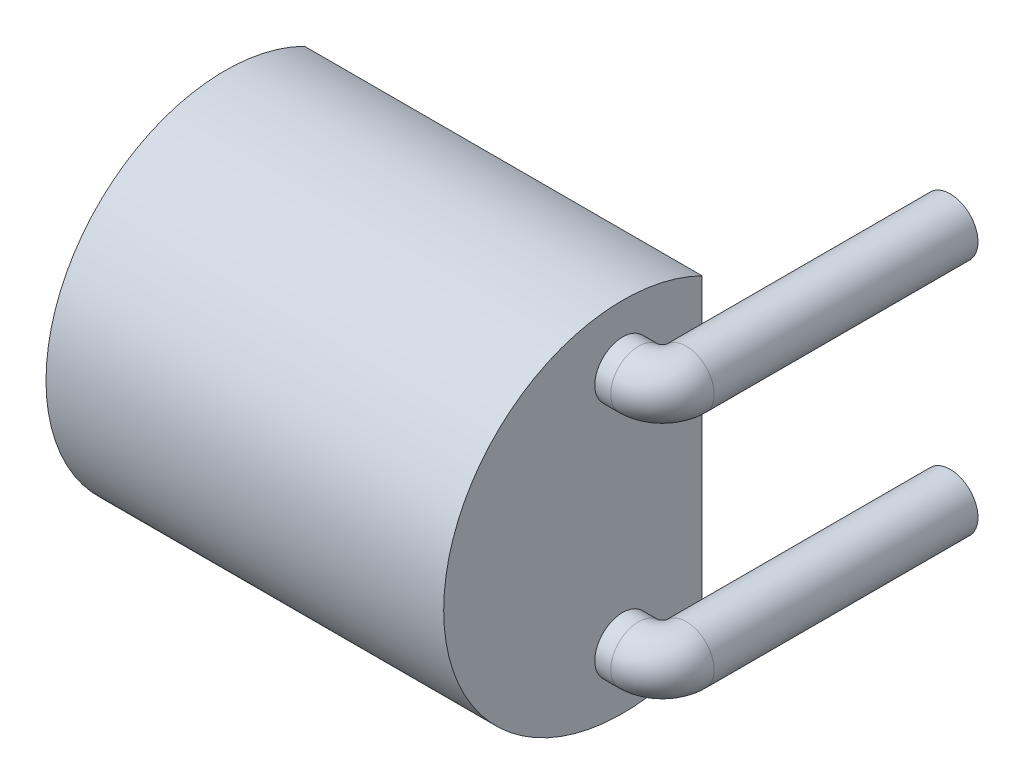
ISO-10303-21;
HEADER;
FILE_DESCRIPTION(('STEP AP214'),'2;1');
FILE_NAME('part.step','',(''),(''),'','','');
FILE_SCHEMA(('AUTOMOTIVE_DESIGN { 1 0 10303 214 1 1 1 1 }'));
ENDSEC;
DATA;
#1=APPLICATION_CONTEXT('core data for automotive mechanical design processes');
#2=APPLICATION_PROTOCOL_DEFINITION('international standard','automotive_design',2000,#1);
#3=PRODUCT_CONTEXT('',#1,'mechanical');
#4=PRODUCT('Part','Part','',(#3));
#5=PRODUCT_RELATED_PRODUCT_CATEGORY('part','',(#4));
#6=PRODUCT_DEFINITION_FORMATION('','',#4);
#7=PRODUCT_DEFINITION_CONTEXT('part definition',#1,'design');
#8=PRODUCT_DEFINITION('design','',#6,#7);
#9=PRODUCT_DEFINITION_SHAPE('','',#8);
#10=(LENGTH_UNIT() NAMED_UNIT(*) SI_UNIT(.MILLI.,.METRE.));
#11=(NAMED_UNIT(*) PLANE_ANGLE_UNIT() SI_UNIT($,.RADIAN.));
#12=(NAMED_UNIT(*) SI_UNIT($,.STERADIAN.) SOLID_ANGLE_UNIT());
#13=UNCERTAINTY_MEASURE_WITH_UNIT(LENGTH_MEASURE(1.E-05),#10,'distance_accuracy_value','');
#14=(GEOMETRIC_REPRESENTATION_CONTEXT(3) GLOBAL_UNCERTAINTY_ASSIGNED_CONTEXT((#13)) GLOBAL_UNIT_ASSIGNED_CONTEXT((#10,
#11,#12)) REPRESENTATION_CONTEXT('',''));
#15=CARTESIAN_POINT('',(0.,0.,0.));
#16=DIRECTION('',(0.,0.,1.));
#17=DIRECTION('',(1.,0.,0.));
#18=AXIS2_PLACEMENT_3D('',#15,#16,#17);
#19=CARTESIAN_POINT('',(5.,1.50000000000005,8.99999999999996));
#20=DIRECTION('',(1.,0.,0.));
#21=DIRECTION('',(0.,1.,0.));
#22=AXIS2_PLACEMENT_3D('',#19,#20,#21);
#23=CYLINDRICAL_SURFACE('',#22,0.35);
#24=CARTESIAN_POINT('',(5.5,1.50000000000005,8.99999999999996));
#25=DIRECTION('',(0.707106781186548,0.,-0.707106781186547));
#26=DIRECTION('',(0.707106781186547,0.,0.707106781186548));
#27=AXIS2_PLACEMENT_3D('',#24,#25,#26);
#28=ELLIPSE('',#27,0.494974746830584,0.35);
#29=CARTESIAN_POINT('',(5.2,1.31972243622685,8.69999999999997));
#30=VERTEX_POINT('',#29);
#31=CARTESIAN_POINT('',(5.2,1.68027756377325,8.69999999999996));
#32=VERTEX_POINT('',#31);
#33=EDGE_CURVE('E76',#30,#32,#28,.T.);
#34=ORIENTED_EDGE('',*,*,#33,.F.);
#35=CARTESIAN_POINT('',(5.2,1.50000000000005,8.99999999999996));
#36=DIRECTION('',(1.,0.,0.));
#37=DIRECTION('',(0.,1.,0.));
#38=AXIS2_PLACEMENT_3D('',#35,#36,#37);
#39=CIRCLE('',#38,0.35);
#40=EDGE_CURVE('E53',#30,#32,#39,.F.);
#41=ORIENTED_EDGE('',*,*,#40,.T.);
#42=EDGE_LOOP('',(#34,#41));
#43=FACE_BOUND('',#42,.T.);
#44=CARTESIAN_POINT('',(5.,1.50000000000005,8.99999999999996));
#45=DIRECTION('',(1.,0.,0.));
#46=DIRECTION('',(0.,1.,0.));
#47=AXIS2_PLACEMENT_3D('',#44,#45,#46);
#48=CIRCLE('',#47,0.35);
#49=CARTESIAN_POINT('',(5.,1.85000000000005,8.99999999999996));
#50=VERTEX_POINT('',#49);
#51=EDGE_CURVE('E113',#50,#50,#48,.T.);
#52=ORIENTED_EDGE('',*,*,#51,.T.);
#53=EDGE_LOOP('',(#52));
#54=FACE_BOUND('',#53,.T.);
#55=ADVANCED_FACE('F31',(#43,#54),#23,.T.);
#56=CARTESIAN_POINT('',(5.,-1.49999999999995,8.99999999999996));
#57=DIRECTION('',(1.,0.,0.));
#58=DIRECTION('',(0.,1.,0.));
#59=AXIS2_PLACEMENT_3D('',#56,#57,#58);
#60=CYLINDRICAL_SURFACE('',#59,0.35);
#61=CARTESIAN_POINT('',(5.49999999999999,-1.49999999999995,8.99999999999996));
#62=DIRECTION('',(0.707106781186548,0.,-0.707106781186547));
#63=DIRECTION('',(0.707106781186547,0.,0.707106781186548));
#64=AXIS2_PLACEMENT_3D('',#61,#62,#63);
#65=ELLIPSE('',#64,0.494974746830584,0.35);
#66=CARTESIAN_POINT('',(5.2,-1.68027756377316,8.69999999999997));
#67=VERTEX_POINT('',#66);
#68=CARTESIAN_POINT('',(5.2,-1.31972243622674,8.69999999999996));
#69=VERTEX_POINT('',#68);
#70=EDGE_CURVE('E74',#67,#69,#65,.T.);
#71=ORIENTED_EDGE('',*,*,#70,.F.);
#72=CARTESIAN_POINT('',(5.2,-1.49999999999995,8.99999999999996));
#73=DIRECTION('',(1.,0.,0.));
#74=DIRECTION('',(0.,1.,0.));
#75=AXIS2_PLACEMENT_3D('',#72,#73,#74);
#76=CIRCLE('',#75,0.35);
#77=EDGE_CURVE('E46',#67,#69,#76,.F.);
#78=ORIENTED_EDGE('',*,*,#77,.T.);
#79=EDGE_LOOP('',(#71,#78));
#80=FACE_BOUND('',#79,.T.);
#81=CARTESIAN_POINT('',(5.,-1.49999999999995,8.99999999999996));
#82=DIRECTION('',(1.,0.,0.));
#83=DIRECTION('',(0.,1.,0.));
#84=AXIS2_PLACEMENT_3D('',#81,#82,#83);
#85=CIRCLE('',#84,0.35);
#86=CARTESIAN_POINT('',(5.,-1.14999999999995,8.99999999999996));
#87=VERTEX_POINT('',#86);
#88=EDGE_CURVE('E117',#87,#87,#85,.T.);
#89=ORIENTED_EDGE('',*,*,#88,.T.);
#90=EDGE_LOOP('',(#89));
#91=FACE_BOUND('',#90,.T.);
#92=ADVANCED_FACE('F72',(#80,#91),#60,.T.);
#93=CARTESIAN_POINT('',(0.,0.,8.99999999999996));
#94=DIRECTION('',(-1.,0.,0.));
#95=DIRECTION('',(0.,-1.,0.));
#96=AXIS2_PLACEMENT_3D('',#93,#94,#95);
#97=PLANE('',#96);
#98=CARTESIAN_POINT('',(0.,0.,8.99999999999996));
#99=DIRECTION('',(1.,0.,0.));
#100=DIRECTION('',(0.,1.,0.));
#101=AXIS2_PLACEMENT_3D('',#98,#99,#100);
#102=CIRCLE('',#101,2.25);
#103=CARTESIAN_POINT('',(0.,2.01556443707459,7.99999999999996));
#104=VERTEX_POINT('',#103);
#105=CARTESIAN_POINT('',(0.,-2.01556443707459,7.99999999999996));
#106=VERTEX_POINT('',#105);
#107=EDGE_CURVE('E39',#104,#106,#102,.T.);
#108=ORIENTED_EDGE('',*,*,#107,.F.);
#109=DIRECTION('',(0.,-1.,0.));
#110=VECTOR('',#109,1.);
#111=CARTESIAN_POINT('',(0.,0.,7.99999999999996));
#112=LINE('',#111,#110);
#113=EDGE_CURVE('E109',#104,#106,#112,.T.);
#114=ORIENTED_EDGE('',*,*,#113,.T.);
#115=EDGE_LOOP('',(#108,#114));
#116=FACE_BOUND('',#115,.T.);
#117=ADVANCED_FACE('F149',(#116),#97,.T.);
#118=CARTESIAN_POINT('',(5.,0.,8.99999999999996));
#119=DIRECTION('',(-1.,0.,0.));
#120=DIRECTION('',(0.,-1.,0.));
#121=AXIS2_PLACEMENT_3D('',#118,#119,#120);
#122=PLANE('',#121);
#123=ORIENTED_EDGE('',*,*,#51,.F.);
#124=EDGE_LOOP('',(#123));
#125=FACE_BOUND('',#124,.T.);
#126=ORIENTED_EDGE('',*,*,#88,.F.);
#127=EDGE_LOOP('',(#126));
#128=FACE_BOUND('',#127,.T.);
#129=DIRECTION('',(0.,-1.,0.));
#130=VECTOR('',#129,1.);
#131=CARTESIAN_POINT('',(5.,2.01556443707459,7.99999999999996));
#132=LINE('',#131,#130);
#133=CARTESIAN_POINT('',(5.,2.01556443707459,7.99999999999996));
#134=VERTEX_POINT('',#133);
#135=CARTESIAN_POINT('',(5.,-2.01556443707459,7.99999999999996));
#136=VERTEX_POINT('',#135);
#137=EDGE_CURVE('E104',#134,#136,#132,.T.);
#138=ORIENTED_EDGE('',*,*,#137,.F.);
#139=CARTESIAN_POINT('',(5.,0.,8.99999999999996));
#140=DIRECTION('',(1.,0.,0.));
#141=DIRECTION('',(0.,1.,0.));
#142=AXIS2_PLACEMENT_3D('',#139,#140,#141);
#143=CIRCLE('',#142,2.25);
#144=EDGE_CURVE('E11',#136,#134,#143,.F.);
#145=ORIENTED_EDGE('',*,*,#144,.F.);
#146=EDGE_LOOP('',(#138,#145));
#147=FACE_BOUND('',#146,.T.);
#148=ADVANCED_FACE('F154',(#125,#128,#147),#122,.F.);
#149=CARTESIAN_POINT('',(0.,0.,8.99999999999996));
#150=DIRECTION('',(1.,0.,0.));
#151=DIRECTION('',(0.,1.,0.));
#152=AXIS2_PLACEMENT_3D('',#149,#150,#151);
#153=CYLINDRICAL_SURFACE('',#152,2.25);
#154=ORIENTED_EDGE('',*,*,#144,.T.);
#155=DIRECTION('',(-1.,0.,0.));
#156=VECTOR('',#155,1.);
#157=CARTESIAN_POINT('',(5.,2.01556443707459,7.99999999999996));
#158=LINE('',#157,#156);
#159=EDGE_CURVE('E107',#134,#104,#158,.T.);
#160=ORIENTED_EDGE('',*,*,#159,.T.);
#161=ORIENTED_EDGE('',*,*,#107,.T.);
#162=DIRECTION('',(-1.,0.,0.));
#163=VECTOR('',#162,1.);
#164=CARTESIAN_POINT('',(5.,-2.01556443707458,7.99999999999996));
#165=LINE('',#164,#163);
#166=EDGE_CURVE('E106',#136,#106,#165,.T.);
#167=ORIENTED_EDGE('',*,*,#166,.F.);
#168=EDGE_LOOP('',(#154,#160,#161,#167));
#169=FACE_BOUND('',#168,.T.);
#170=ADVANCED_FACE('F160',(#169),#153,.T.);
#171=CARTESIAN_POINT('',(5.,2.01556443707459,7.99999999999996));
#172=DIRECTION('',(0.,0.,-1.));
#173=DIRECTION('',(-1.,0.,0.));
#174=AXIS2_PLACEMENT_3D('',#171,#172,#173);
#175=PLANE('',#174);
#176=ORIENTED_EDGE('',*,*,#113,.F.);
#177=ORIENTED_EDGE('',*,*,#159,.F.);
#178=ORIENTED_EDGE('',*,*,#137,.T.);
#179=ORIENTED_EDGE('',*,*,#166,.T.);
#180=EDGE_LOOP('',(#176,#177,#178,#179));
#181=FACE_BOUND('',#180,.T.);
#182=ADVANCED_FACE('F139',(#181),#175,.T.);
#183=CARTESIAN_POINT('',(5.5,1.50000000000005,8.69999999999996));
#184=DIRECTION('',(0.,0.,-1.));
#185=DIRECTION('',(-1.,0.,0.));
#186=AXIS2_PLACEMENT_3D('',#183,#184,#185);
#187=CYLINDRICAL_SURFACE('',#186,0.350000000000001);
#188=CARTESIAN_POINT('',(5.5,1.50000000000005,8.69999999999996));
#189=DIRECTION('',(0.,0.,-1.));
#190=DIRECTION('',(0.,1.,0.));
#191=AXIS2_PLACEMENT_3D('',#188,#189,#190);
#192=CIRCLE('',#191,0.350000000000001);
#193=EDGE_CURVE('E81',#32,#30,#192,.T.);
#194=ORIENTED_EDGE('',*,*,#193,.T.);
#195=ORIENTED_EDGE('',*,*,#33,.T.);
#196=EDGE_LOOP('',(#194,#195));
#197=FACE_BOUND('',#196,.T.);
#198=CARTESIAN_POINT('',(5.5,1.50000000000005,5.3821704001239));
#199=DIRECTION('',(0.,0.,-1.));
#200=DIRECTION('',(0.,1.,0.));
#201=AXIS2_PLACEMENT_3D('',#198,#199,#200);
#202=CIRCLE('',#201,0.350000000000001);
#203=CARTESIAN_POINT('',(5.5,1.85000000000005,5.3821704001239));
#204=VERTEX_POINT('',#203);
#205=EDGE_CURVE('E93',#204,#204,#202,.T.);
#206=ORIENTED_EDGE('',*,*,#205,.F.);
#207=EDGE_LOOP('',(#206));
#208=FACE_BOUND('',#207,.T.);
#209=ADVANCED_FACE('F127',(#197,#208),#187,.T.);
#210=CARTESIAN_POINT('',(5.2,1.50000000000005,8.39999999999996));
#211=DIRECTION('',(-1.,0.,0.));
#212=DIRECTION('',(0.,0.,-1.));
#213=AXIS2_PLACEMENT_3D('',#210,#211,#212);
#214=CIRCLE('',#213,0.350000000000001);
#215=TRIMMED_CURVE('',#214,(PARAMETER_VALUE(-2.60049312763264)),
(PARAMETER_VALUE(2.60049312763264)),.T.,.PARAMETER.);
#216=CARTESIAN_POINT('',(5.2,1.50000000000005,8.69999999999996));
#217=DIRECTION('',(0.,-1.,0.));
#218=AXIS1_PLACEMENT('',#216,#217);
#219=SURFACE_OF_REVOLUTION('',#215,#218);
#220=ORIENTED_EDGE('',*,*,#193,.F.);
#221=ORIENTED_EDGE('',*,*,#40,.F.);
#222=EDGE_LOOP('',(#220,#221));
#223=FACE_BOUND('',#222,.T.);
#224=ADVANCED_FACE('F129',(#223),#219,.T.);
#225=CARTESIAN_POINT('',(5.5,1.50000000000005,5.3821704001239));
#226=DIRECTION('',(0.,0.,-1.));
#227=DIRECTION('',(0.,1.,0.));
#228=AXIS2_PLACEMENT_3D('',#225,#226,#227);
#229=PLANE('',#228);
#230=ORIENTED_EDGE('',*,*,#205,.T.);
#231=EDGE_LOOP('',(#230));
#232=FACE_BOUND('',#231,.T.);
#233=ADVANCED_FACE('F131',(#232),#229,.T.);
#234=CARTESIAN_POINT('',(5.49999999999999,-1.49999999999995,8.69999999999996));
#235=DIRECTION('',(0.,0.,-1.));
#236=DIRECTION('',(-1.,0.,0.));
#237=AXIS2_PLACEMENT_3D('',#234,#235,#236);
#238=CYLINDRICAL_SURFACE('',#237,0.350000000000001);
#239=CARTESIAN_POINT('',(5.49999999999999,-1.49999999999995,8.69999999999996));
#240=DIRECTION('',(0.,0.,-1.));
#241=DIRECTION('',(0.,1.,0.));
#242=AXIS2_PLACEMENT_3D('',#239,#240,#241);
#243=CIRCLE('',#242,0.350000000000001);
#244=EDGE_CURVE('E80',#69,#67,#243,.T.);
#245=ORIENTED_EDGE('',*,*,#244,.T.);
#246=ORIENTED_EDGE('',*,*,#70,.T.);
#247=EDGE_LOOP('',(#245,#246));
#248=FACE_BOUND('',#247,.T.);
#249=CARTESIAN_POINT('',(5.5,-1.49999999999995,5.38217040012389));
#250=DIRECTION('',(0.,0.,-1.));
#251=DIRECTION('',(0.,1.,0.));
#252=AXIS2_PLACEMENT_3D('',#249,#250,#251);
#253=CIRCLE('',#252,0.350000000000001);
#254=CARTESIAN_POINT('',(5.5,-1.14999999999995,5.38217040012389));
#255=VERTEX_POINT('',#254);
#256=EDGE_CURVE('E82',#255,#255,#253,.T.);
#257=ORIENTED_EDGE('',*,*,#256,.F.);
#258=EDGE_LOOP('',(#257));
#259=FACE_BOUND('',#258,.T.);
#260=ADVANCED_FACE('F78',(#248,#259),#238,.T.);
#261=CARTESIAN_POINT('',(5.2,-1.49999999999995,8.39999999999997));
#262=DIRECTION('',(-1.,0.,0.));
#263=DIRECTION('',(0.,0.,-1.));
#264=AXIS2_PLACEMENT_3D('',#261,#262,#263);
#265=CIRCLE('',#264,0.350000000000001);
#266=TRIMMED_CURVE('',#265,(PARAMETER_VALUE(-2.60049312763263)),
(PARAMETER_VALUE(2.60049312763263)),.T.,.PARAMETER.);
#267=CARTESIAN_POINT('',(5.2,-1.49999999999995,8.69999999999996));
#268=DIRECTION('',(0.,-1.,0.));
#269=AXIS1_PLACEMENT('',#267,#268);
#270=SURFACE_OF_REVOLUTION('',#266,#269);
#271=ORIENTED_EDGE('',*,*,#244,.F.);
#272=ORIENTED_EDGE('',*,*,#77,.F.);
#273=EDGE_LOOP('',(#271,#272));
#274=FACE_BOUND('',#273,.T.);
#275=ADVANCED_FACE('F84',(#274),#270,.T.);
#276=CARTESIAN_POINT('',(5.5,-1.49999999999995,5.38217040012389));
#277=DIRECTION('',(0.,0.,-1.));
#278=DIRECTION('',(0.,1.,0.));
#279=AXIS2_PLACEMENT_3D('',#276,#277,#278);
#280=PLANE('',#279);
#281=ORIENTED_EDGE('',*,*,#256,.T.);
#282=EDGE_LOOP('',(#281));
#283=FACE_BOUND('',#282,.T.);
#284=ADVANCED_FACE('F143',(#283),#280,.T.);
#285=CLOSED_SHELL('',(#55,#92,#117,#148,#170,#182,#209,#224,#233,#260,#275,#284));
#286=MANIFOLD_SOLID_BREP('B2',#285);
#287=ADVANCED_BREP_SHAPE_REPRESENTATION('',(#18,#286),#14);
#288=SHAPE_DEFINITION_REPRESENTATION(#9,#287);
ENDSEC;
END-ISO-10303-21;
